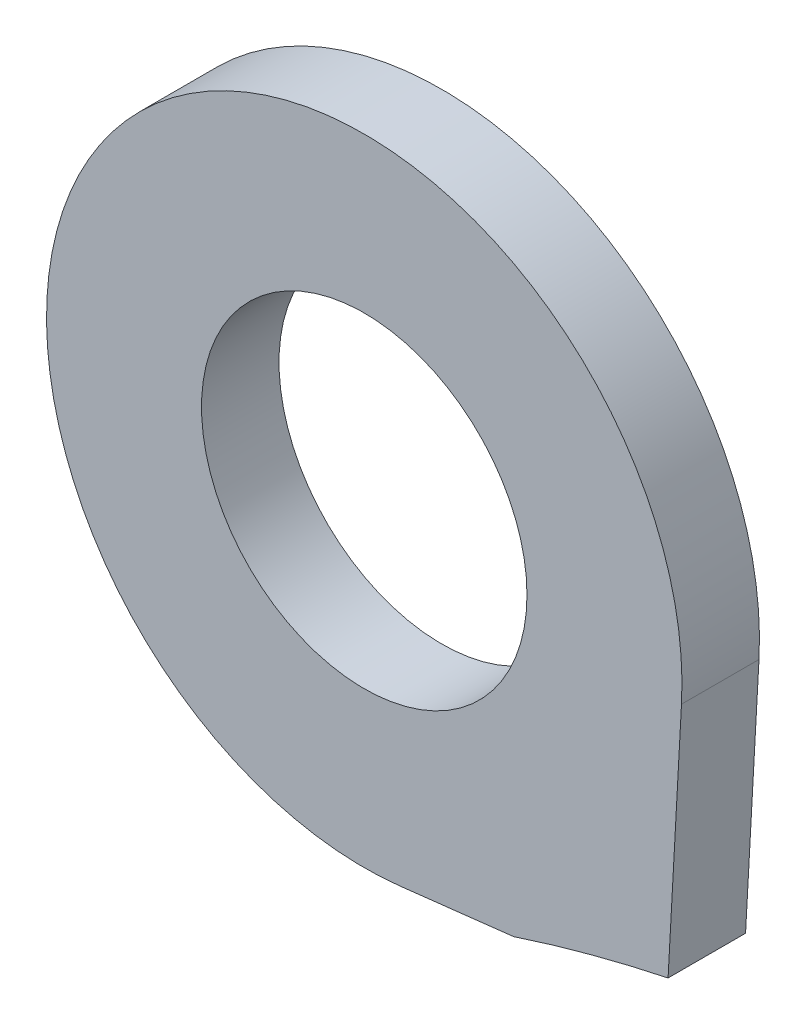
ISO-10303-21;
HEADER;
FILE_DESCRIPTION(('STEP AP214'),'2;1');
FILE_NAME('part.step','',(''),(''),'','','');
FILE_SCHEMA(('AUTOMOTIVE_DESIGN { 1 0 10303 214 1 1 1 1 }'));
ENDSEC;
DATA;
#1=APPLICATION_CONTEXT('core data for automotive mechanical design processes');
#2=APPLICATION_PROTOCOL_DEFINITION('international standard','automotive_design',2000,#1);
#3=PRODUCT_CONTEXT('',#1,'mechanical');
#4=PRODUCT('Part','Part','',(#3));
#5=PRODUCT_RELATED_PRODUCT_CATEGORY('part','',(#4));
#6=PRODUCT_DEFINITION_FORMATION('','',#4);
#7=PRODUCT_DEFINITION_CONTEXT('part definition',#1,'design');
#8=PRODUCT_DEFINITION('design','',#6,#7);
#9=PRODUCT_DEFINITION_SHAPE('','',#8);
#10=(LENGTH_UNIT() NAMED_UNIT(*) SI_UNIT(.MILLI.,.METRE.));
#11=(NAMED_UNIT(*) PLANE_ANGLE_UNIT() SI_UNIT($,.RADIAN.));
#12=(NAMED_UNIT(*) SI_UNIT($,.STERADIAN.) SOLID_ANGLE_UNIT());
#13=UNCERTAINTY_MEASURE_WITH_UNIT(LENGTH_MEASURE(1.E-05),#10,'distance_accuracy_value','');
#14=(GEOMETRIC_REPRESENTATION_CONTEXT(3) GLOBAL_UNCERTAINTY_ASSIGNED_CONTEXT((#13)) GLOBAL_UNIT_ASSIGNED_CONTEXT((#10,
#11,#12)) REPRESENTATION_CONTEXT('',''));
#15=CARTESIAN_POINT('',(0.,0.,0.));
#16=DIRECTION('',(0.,0.,1.));
#17=DIRECTION('',(1.,0.,0.));
#18=AXIS2_PLACEMENT_3D('',#15,#16,#17);
#19=CARTESIAN_POINT('',(-1.94289029309402E-13,-44.9000000000001,1.));
#20=DIRECTION('',(0.,0.,-1.));
#21=DIRECTION('',(-1.,0.,0.));
#22=AXIS2_PLACEMENT_3D('',#19,#20,#21);
#23=PLANE('',#22);
#24=CARTESIAN_POINT('',(-1.94289029309402E-13,-44.9000000000001,1.));
#25=DIRECTION('',(0.,0.,-1.));
#26=DIRECTION('',(-1.,0.,0.));
#27=AXIS2_PLACEMENT_3D('',#24,#25,#26);
#28=CIRCLE('',#27,18.675);
#29=CARTESIAN_POINT('',(-5.82264205787284,-27.155917480301,1.));
#30=VERTEX_POINT('',#29);
#31=CARTESIAN_POINT('',(-3.82948532058821,-26.6218527421569,1.));
#32=VERTEX_POINT('',#31);
#33=EDGE_CURVE('E89',#30,#32,#28,.T.);
#34=ORIENTED_EDGE('',*,*,#33,.T.);
#35=DIRECTION('',(0.0549897619043603,0.998486918334788,0.));
#36=VECTOR('',#35,1.);
#37=CARTESIAN_POINT('',(-3.65620363482743,-23.4754580238081,1.));
#38=LINE('',#37,#36);
#39=CARTESIAN_POINT('',(-3.65620363482743,-23.4754580238081,1.));
#40=VERTEX_POINT('',#39);
#41=EDGE_CURVE('E84',#32,#40,#38,.T.);
#42=ORIENTED_EDGE('',*,*,#41,.T.);
#43=CARTESIAN_POINT('',(-7.75000000000006,-23.2500000000002,1.));
#44=DIRECTION('',(0.,0.,1.));
#45=DIRECTION('',(-1.,0.,0.));
#46=AXIS2_PLACEMENT_3D('',#43,#44,#45);
#47=CIRCLE('',#46,4.1);
#48=CARTESIAN_POINT('',(-7.28307843310625,-27.3233259445288,1.));
#49=VERTEX_POINT('',#48);
#50=EDGE_CURVE('E87',#40,#49,#47,.T.);
#51=ORIENTED_EDGE('',*,*,#50,.T.);
#52=DIRECTION('',(0.993494132811842,0.113883308998491,0.));
#53=VECTOR('',#52,1.);
#54=CARTESIAN_POINT('',(-5.82264205787284,-27.155917480301,1.));
#55=LINE('',#54,#53);
#56=EDGE_CURVE('E54',#49,#30,#55,.T.);
#57=ORIENTED_EDGE('',*,*,#56,.T.);
#58=EDGE_LOOP('',(#34,#42,#51,#57));
#59=FACE_BOUND('',#58,.T.);
#60=CARTESIAN_POINT('',(-7.75000000000006,-23.2500000000002,1.));
#61=DIRECTION('',(0.,0.,1.));
#62=DIRECTION('',(1.,0.,0.));
#63=AXIS2_PLACEMENT_3D('',#60,#61,#62);
#64=CIRCLE('',#63,2.1);
#65=CARTESIAN_POINT('',(-5.65000000000006,-23.2500000000002,1.));
#66=VERTEX_POINT('',#65);
#67=EDGE_CURVE('E104',#66,#66,#64,.T.);
#68=ORIENTED_EDGE('',*,*,#67,.F.);
#69=EDGE_LOOP('',(#68));
#70=FACE_BOUND('',#69,.T.);
#71=ADVANCED_FACE('F37',(#59,#70),#23,.F.);
#72=CARTESIAN_POINT('',(-1.94289029309402E-13,-44.9000000000001,0.));
#73=DIRECTION('',(0.,0.,-1.));
#74=DIRECTION('',(-1.,0.,0.));
#75=AXIS2_PLACEMENT_3D('',#72,#73,#74);
#76=PLANE('',#75);
#77=CARTESIAN_POINT('',(-1.94289029309402E-13,-44.9000000000001,0.));
#78=DIRECTION('',(0.,0.,-1.));
#79=DIRECTION('',(-1.,0.,0.));
#80=AXIS2_PLACEMENT_3D('',#77,#78,#79);
#81=CIRCLE('',#80,18.675);
#82=CARTESIAN_POINT('',(-5.82264205787284,-27.155917480301,0.));
#83=VERTEX_POINT('',#82);
#84=CARTESIAN_POINT('',(-3.82948532058821,-26.6218527421569,0.));
#85=VERTEX_POINT('',#84);
#86=EDGE_CURVE('E101',#83,#85,#81,.T.);
#87=ORIENTED_EDGE('',*,*,#86,.F.);
#88=DIRECTION('',(0.993494132811842,0.113883308998491,0.));
#89=VECTOR('',#88,1.);
#90=CARTESIAN_POINT('',(-5.82264205787284,-27.155917480301,0.));
#91=LINE('',#90,#89);
#92=CARTESIAN_POINT('',(-7.28307843310625,-27.3233259445288,0.));
#93=VERTEX_POINT('',#92);
#94=EDGE_CURVE('E77',#93,#83,#91,.T.);
#95=ORIENTED_EDGE('',*,*,#94,.F.);
#96=CARTESIAN_POINT('',(-7.75000000000006,-23.2500000000002,0.));
#97=DIRECTION('',(0.,0.,1.));
#98=DIRECTION('',(-1.,0.,0.));
#99=AXIS2_PLACEMENT_3D('',#96,#97,#98);
#100=CIRCLE('',#99,4.1);
#101=CARTESIAN_POINT('',(-3.65620363482743,-23.4754580238081,0.));
#102=VERTEX_POINT('',#101);
#103=EDGE_CURVE('E71',#102,#93,#100,.T.);
#104=ORIENTED_EDGE('',*,*,#103,.F.);
#105=DIRECTION('',(0.0549897619043603,0.998486918334788,0.));
#106=VECTOR('',#105,1.);
#107=CARTESIAN_POINT('',(-3.65620363482743,-23.4754580238081,0.));
#108=LINE('',#107,#106);
#109=EDGE_CURVE('E93',#85,#102,#108,.T.);
#110=ORIENTED_EDGE('',*,*,#109,.F.);
#111=EDGE_LOOP('',(#87,#95,#104,#110));
#112=FACE_BOUND('',#111,.T.);
#113=CARTESIAN_POINT('',(-7.75000000000006,-23.2500000000002,0.));
#114=DIRECTION('',(0.,0.,1.));
#115=DIRECTION('',(1.,0.,0.));
#116=AXIS2_PLACEMENT_3D('',#113,#114,#115);
#117=CIRCLE('',#116,2.1);
#118=CARTESIAN_POINT('',(-5.65000000000006,-23.2500000000002,0.));
#119=VERTEX_POINT('',#118);
#120=EDGE_CURVE('E116',#119,#119,#117,.T.);
#121=ORIENTED_EDGE('',*,*,#120,.T.);
#122=EDGE_LOOP('',(#121));
#123=FACE_BOUND('',#122,.T.);
#124=ADVANCED_FACE('F112',(#112,#123),#76,.T.);
#125=CARTESIAN_POINT('',(-1.94289029309402E-13,-44.9000000000001,1.));
#126=DIRECTION('',(0.,0.,-1.));
#127=DIRECTION('',(-1.,0.,0.));
#128=AXIS2_PLACEMENT_3D('',#125,#126,#127);
#129=CYLINDRICAL_SURFACE('',#128,18.675);
#130=ORIENTED_EDGE('',*,*,#86,.T.);
#131=DIRECTION('',(0.,0.,-1.));
#132=VECTOR('',#131,1.);
#133=CARTESIAN_POINT('',(-3.82948532058821,-26.6218527421569,1.));
#134=LINE('',#133,#132);
#135=EDGE_CURVE('E11',#32,#85,#134,.T.);
#136=ORIENTED_EDGE('',*,*,#135,.F.);
#137=ORIENTED_EDGE('',*,*,#33,.F.);
#138=DIRECTION('',(0.,0.,-1.));
#139=VECTOR('',#138,1.);
#140=CARTESIAN_POINT('',(-5.82264205787284,-27.155917480301,1.));
#141=LINE('',#140,#139);
#142=EDGE_CURVE('E97',#30,#83,#141,.T.);
#143=ORIENTED_EDGE('',*,*,#142,.T.);
#144=EDGE_LOOP('',(#130,#136,#137,#143));
#145=FACE_BOUND('',#144,.T.);
#146=ADVANCED_FACE('F39',(#145),#129,.F.);
#147=CARTESIAN_POINT('',(-3.65620363482743,-23.4754580238081,1.));
#148=DIRECTION('',(-0.998486918334788,0.0549897619043603,0.));
#149=DIRECTION('',(-0.0549897619043603,-0.998486918334788,0.));
#150=AXIS2_PLACEMENT_3D('',#147,#148,#149);
#151=PLANE('',#150);
#152=ORIENTED_EDGE('',*,*,#109,.T.);
#153=DIRECTION('',(0.,0.,-1.));
#154=VECTOR('',#153,1.);
#155=CARTESIAN_POINT('',(-3.65620363482743,-23.4754580238081,1.));
#156=LINE('',#155,#154);
#157=EDGE_CURVE('E46',#40,#102,#156,.T.);
#158=ORIENTED_EDGE('',*,*,#157,.F.);
#159=ORIENTED_EDGE('',*,*,#41,.F.);
#160=ORIENTED_EDGE('',*,*,#135,.T.);
#161=EDGE_LOOP('',(#152,#158,#159,#160));
#162=FACE_BOUND('',#161,.T.);
#163=ADVANCED_FACE('F92',(#162),#151,.F.);
#164=CARTESIAN_POINT('',(-7.75000000000006,-23.2500000000002,1.));
#165=DIRECTION('',(0.,0.,-1.));
#166=DIRECTION('',(-1.,0.,0.));
#167=AXIS2_PLACEMENT_3D('',#164,#165,#166);
#168=CYLINDRICAL_SURFACE('',#167,4.1);
#169=ORIENTED_EDGE('',*,*,#103,.T.);
#170=DIRECTION('',(0.,0.,-1.));
#171=VECTOR('',#170,1.);
#172=CARTESIAN_POINT('',(-7.28307843310625,-27.3233259445288,1.));
#173=LINE('',#172,#171);
#174=EDGE_CURVE('E94',#49,#93,#173,.T.);
#175=ORIENTED_EDGE('',*,*,#174,.F.);
#176=ORIENTED_EDGE('',*,*,#50,.F.);
#177=ORIENTED_EDGE('',*,*,#157,.T.);
#178=EDGE_LOOP('',(#169,#175,#176,#177));
#179=FACE_BOUND('',#178,.T.);
#180=ADVANCED_FACE('F95',(#179),#168,.T.);
#181=CARTESIAN_POINT('',(-5.82264205787284,-27.155917480301,1.));
#182=DIRECTION('',(-0.113883308998491,0.993494132811842,0.));
#183=DIRECTION('',(-0.993494132811842,-0.113883308998491,0.));
#184=AXIS2_PLACEMENT_3D('',#181,#182,#183);
#185=PLANE('',#184);
#186=ORIENTED_EDGE('',*,*,#94,.T.);
#187=ORIENTED_EDGE('',*,*,#142,.F.);
#188=ORIENTED_EDGE('',*,*,#56,.F.);
#189=ORIENTED_EDGE('',*,*,#174,.T.);
#190=EDGE_LOOP('',(#186,#187,#188,#189));
#191=FACE_BOUND('',#190,.T.);
#192=ADVANCED_FACE('F109',(#191),#185,.F.);
#193=CARTESIAN_POINT('',(-7.75000000000006,-23.2500000000002,1.));
#194=DIRECTION('',(0.,0.,-1.));
#195=DIRECTION('',(-1.,0.,0.));
#196=AXIS2_PLACEMENT_3D('',#193,#194,#195);
#197=CYLINDRICAL_SURFACE('',#196,2.1);
#198=ORIENTED_EDGE('',*,*,#67,.T.);
#199=EDGE_LOOP('',(#198));
#200=FACE_BOUND('',#199,.T.);
#201=ORIENTED_EDGE('',*,*,#120,.F.);
#202=EDGE_LOOP('',(#201));
#203=FACE_BOUND('',#202,.T.);
#204=ADVANCED_FACE('F122',(#200,#203),#197,.F.);
#205=CLOSED_SHELL('',(#71,#124,#146,#163,#180,#192,#204));
#206=MANIFOLD_SOLID_BREP('B2',#205);
#207=ADVANCED_BREP_SHAPE_REPRESENTATION('',(#18,#206),#14);
#208=SHAPE_DEFINITION_REPRESENTATION(#9,#207);
ENDSEC;
END-ISO-10303-21;
